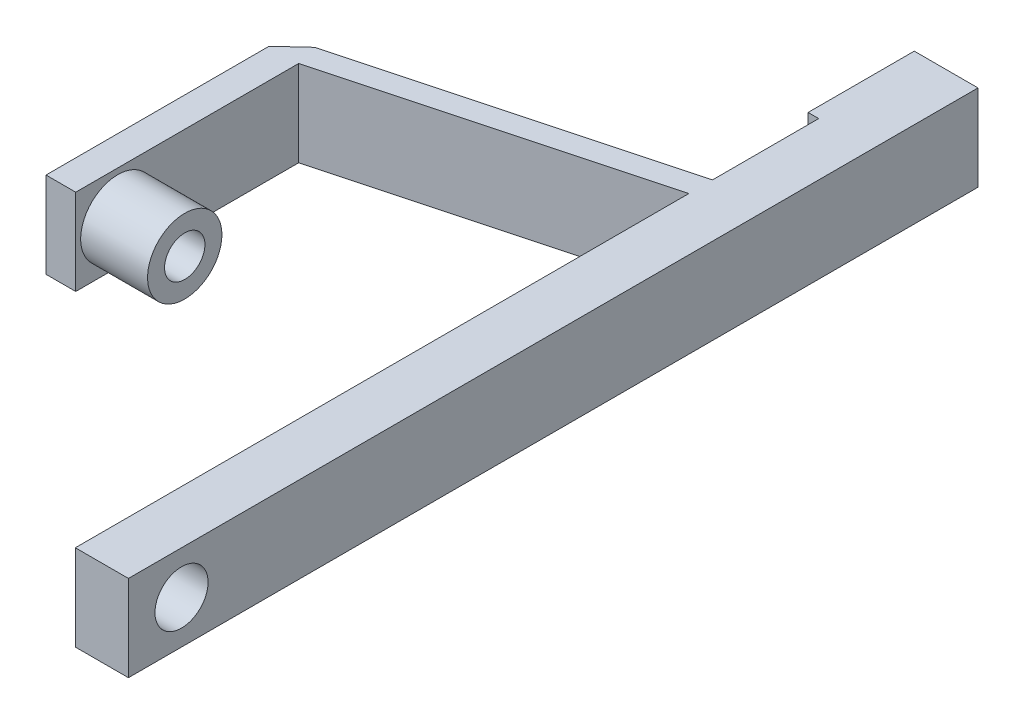
ISO-10303-21;
HEADER;
FILE_DESCRIPTION(('STEP AP214'),'2;1');
FILE_NAME('part.step','',(''),(''),'','','');
FILE_SCHEMA(('AUTOMOTIVE_DESIGN { 1 0 10303 214 1 1 1 1 }'));
ENDSEC;
DATA;
#1=APPLICATION_CONTEXT('core data for automotive mechanical design processes');
#2=APPLICATION_PROTOCOL_DEFINITION('international standard','automotive_design',2000,#1);
#3=PRODUCT_CONTEXT('',#1,'mechanical');
#4=PRODUCT('Part','Part','',(#3));
#5=PRODUCT_RELATED_PRODUCT_CATEGORY('part','',(#4));
#6=PRODUCT_DEFINITION_FORMATION('','',#4);
#7=PRODUCT_DEFINITION_CONTEXT('part definition',#1,'design');
#8=PRODUCT_DEFINITION('design','',#6,#7);
#9=PRODUCT_DEFINITION_SHAPE('','',#8);
#10=(LENGTH_UNIT() NAMED_UNIT(*) SI_UNIT(.MILLI.,.METRE.));
#11=(NAMED_UNIT(*) PLANE_ANGLE_UNIT() SI_UNIT($,.RADIAN.));
#12=(NAMED_UNIT(*) SI_UNIT($,.STERADIAN.) SOLID_ANGLE_UNIT());
#13=UNCERTAINTY_MEASURE_WITH_UNIT(LENGTH_MEASURE(1.E-05),#10,'distance_accuracy_value','');
#14=(GEOMETRIC_REPRESENTATION_CONTEXT(3) GLOBAL_UNCERTAINTY_ASSIGNED_CONTEXT((#13)) GLOBAL_UNIT_ASSIGNED_CONTEXT((#10,
#11,#12)) REPRESENTATION_CONTEXT('',''));
#15=CARTESIAN_POINT('',(0.,0.,0.));
#16=DIRECTION('',(0.,0.,1.));
#17=DIRECTION('',(1.,0.,0.));
#18=AXIS2_PLACEMENT_3D('',#15,#16,#17);
#19=CARTESIAN_POINT('',(-12.6999999999999,20.5739999999995,2.77555756156289E-13));
#20=DIRECTION('',(1.,0.,0.));
#21=DIRECTION('',(0.,0.,-1.));
#22=AXIS2_PLACEMENT_3D('',#19,#20,#21);
#23=PLANE('',#22);
#24=DIRECTION('',(0.,1.00000000000001,0.));
#25=VECTOR('',#24,1.);
#26=CARTESIAN_POINT('',(-12.6999999999999,1.11022302462516E-13,-177.8));
#27=LINE('',#26,#25);
#28=CARTESIAN_POINT('',(-12.6999999999999,1.11022302462516E-13,-177.8));
#29=VERTEX_POINT('',#28);
#30=CARTESIAN_POINT('',(-12.6999999999999,20.5740000000013,-177.8));
#31=VERTEX_POINT('',#30);
#32=EDGE_CURVE('E122',#29,#31,#27,.T.);
#33=ORIENTED_EDGE('',*,*,#32,.F.);
#34=DIRECTION('',(0.,0.,1.));
#35=VECTOR('',#34,1.);
#36=CARTESIAN_POINT('',(-12.6999999999999,0.,3.33066907387547E-13));
#37=LINE('',#36,#35);
#38=CARTESIAN_POINT('',(-12.6999999999999,-4.44089209850063E-13,-152.4));
#39=VERTEX_POINT('',#38);
#40=EDGE_CURVE('E86',#29,#39,#37,.T.);
#41=ORIENTED_EDGE('',*,*,#40,.T.);
#42=DIRECTION('',(0.,-1.00000000000001,0.));
#43=VECTOR('',#42,1.);
#44=CARTESIAN_POINT('',(-12.6999999999999,20.3199999999994,-152.4));
#45=LINE('',#44,#43);
#46=CARTESIAN_POINT('',(-12.6999999999999,20.5740000000018,-152.4));
#47=VERTEX_POINT('',#46);
#48=EDGE_CURVE('E118',#47,#39,#45,.T.);
#49=ORIENTED_EDGE('',*,*,#48,.F.);
#50=DIRECTION('',(0.,0.,1.));
#51=VECTOR('',#50,1.);
#52=CARTESIAN_POINT('',(-12.6999999999999,20.5739999999995,2.77555756156289E-13));
#53=LINE('',#52,#51);
#54=EDGE_CURVE('E166',#31,#47,#53,.T.);
#55=ORIENTED_EDGE('',*,*,#54,.F.);
#56=EDGE_LOOP('',(#33,#41,#49,#55));
#57=FACE_BOUND('',#56,.T.);
#58=ADVANCED_FACE('F40',(#57),#23,.F.);
#59=CARTESIAN_POINT('',(-12.6999999999999,10.2870000000023,-12.6999999999997));
#60=DIRECTION('',(-1.,0.,0.));
#61=DIRECTION('',(0.,0.,1.));
#62=AXIS2_PLACEMENT_3D('',#59,#60,#61);
#63=CIRCLE('',#62,6.35);
#64=CARTESIAN_POINT('',(-12.6999999999999,10.2870000000023,-6.34999999999971));
#65=VERTEX_POINT('',#64);
#66=EDGE_CURVE('E211',#65,#65,#63,.T.);
#67=ORIENTED_EDGE('',*,*,#66,.F.);
#68=EDGE_LOOP('',(#67));
#69=FACE_BOUND('',#68,.T.);
#70=CARTESIAN_POINT('',(-12.6999999999999,20.5739999999999,-146.7612));
#71=VERTEX_POINT('',#70);
#72=CARTESIAN_POINT('',(-12.6999999999999,20.5739999999995,2.77555756156289E-13));
#73=VERTEX_POINT('',#72);
#74=EDGE_CURVE('E165',#71,#73,#53,.T.);
#75=ORIENTED_EDGE('',*,*,#74,.F.);
#76=DIRECTION('',(0.,-1.00000000000001,0.));
#77=VECTOR('',#76,1.);
#78=CARTESIAN_POINT('',(-12.6999999999999,20.3199999999999,-146.7612));
#79=LINE('',#78,#77);
#80=CARTESIAN_POINT('',(-12.6999999999999,0.,-146.761199999999));
#81=VERTEX_POINT('',#80);
#82=EDGE_CURVE('E136',#71,#81,#79,.T.);
#83=ORIENTED_EDGE('',*,*,#82,.T.);
#84=CARTESIAN_POINT('',(-12.6999999999999,0.,3.33066907387547E-13));
#85=VERTEX_POINT('',#84);
#86=EDGE_CURVE('E100',#81,#85,#37,.T.);
#87=ORIENTED_EDGE('',*,*,#86,.T.);
#88=DIRECTION('',(0.,-1.00000000000001,0.));
#89=VECTOR('',#88,1.);
#90=CARTESIAN_POINT('',(-12.6999999999999,20.5739999999995,2.77555756156289E-13));
#91=LINE('',#90,#89);
#92=EDGE_CURVE('E11',#73,#85,#91,.T.);
#93=ORIENTED_EDGE('',*,*,#92,.F.);
#94=EDGE_LOOP('',(#75,#83,#87,#93));
#95=FACE_BOUND('',#94,.T.);
#96=ADVANCED_FACE('F177',(#69,#95),#23,.F.);
#97=CARTESIAN_POINT('',(0.,20.5740000000004,-177.8));
#98=DIRECTION('',(-1.,0.,0.));
#99=DIRECTION('',(0.,0.,1.));
#100=AXIS2_PLACEMENT_3D('',#97,#98,#99);
#101=PLANE('',#100);
#102=CARTESIAN_POINT('',(0.,10.2870000000023,-12.7000000000002));
#103=DIRECTION('',(-1.,0.,0.));
#104=DIRECTION('',(0.,0.,1.));
#105=AXIS2_PLACEMENT_3D('',#102,#103,#104);
#106=CIRCLE('',#105,6.35);
#107=CARTESIAN_POINT('',(0.,10.2870000000023,-6.35000000000016));
#108=VERTEX_POINT('',#107);
#109=EDGE_CURVE('E44',#108,#108,#106,.T.);
#110=ORIENTED_EDGE('',*,*,#109,.T.);
#111=EDGE_LOOP('',(#110));
#112=FACE_BOUND('',#111,.T.);
#113=DIRECTION('',(0.,0.,-1.));
#114=VECTOR('',#113,1.);
#115=CARTESIAN_POINT('',(0.,1.11022302462516E-13,-177.8));
#116=LINE('',#115,#114);
#117=CARTESIAN_POINT('',(0.,0.,0.));
#118=VERTEX_POINT('',#117);
#119=CARTESIAN_POINT('',(2.22044604925031E-13,-3.33066907387547E-13,-203.2));
#120=VERTEX_POINT('',#119);
#121=EDGE_CURVE('E92',#118,#120,#116,.T.);
#122=ORIENTED_EDGE('',*,*,#121,.T.);
#123=DIRECTION('',(0.,-1.00000000000001,0.));
#124=VECTOR('',#123,1.);
#125=CARTESIAN_POINT('',(0.,20.5740000000018,-203.2));
#126=LINE('',#125,#124);
#127=CARTESIAN_POINT('',(0.,20.5740000000018,-203.2));
#128=VERTEX_POINT('',#127);
#129=EDGE_CURVE('E243',#128,#120,#126,.T.);
#130=ORIENTED_EDGE('',*,*,#129,.F.);
#131=DIRECTION('',(0.,0.,-1.));
#132=VECTOR('',#131,1.);
#133=CARTESIAN_POINT('',(0.,20.5740000000004,-177.8));
#134=LINE('',#133,#132);
#135=CARTESIAN_POINT('',(0.,20.5739999999995,0.));
#136=VERTEX_POINT('',#135);
#137=EDGE_CURVE('E85',#136,#128,#134,.T.);
#138=ORIENTED_EDGE('',*,*,#137,.F.);
#139=DIRECTION('',(0.,-1.00000000000001,0.));
#140=VECTOR('',#139,1.);
#141=CARTESIAN_POINT('',(0.,20.5739999999995,0.));
#142=LINE('',#141,#140);
#143=EDGE_CURVE('E49',#136,#118,#142,.T.);
#144=ORIENTED_EDGE('',*,*,#143,.T.);
#145=EDGE_LOOP('',(#122,#130,#138,#144));
#146=FACE_BOUND('',#145,.T.);
#147=ADVANCED_FACE('F42',(#112,#146),#101,.F.);
#148=CARTESIAN_POINT('',(0.,20.5739999999995,0.));
#149=DIRECTION('',(0.,0.,-1.));
#150=DIRECTION('',(-1.,0.,0.));
#151=AXIS2_PLACEMENT_3D('',#148,#149,#150);
#152=PLANE('',#151);
#153=DIRECTION('',(1.,0.,0.));
#154=VECTOR('',#153,1.);
#155=CARTESIAN_POINT('',(0.,0.,0.));
#156=LINE('',#155,#154);
#157=EDGE_CURVE('E77',#85,#118,#156,.T.);
#158=ORIENTED_EDGE('',*,*,#157,.T.);
#159=ORIENTED_EDGE('',*,*,#143,.F.);
#160=DIRECTION('',(1.,0.,0.));
#161=VECTOR('',#160,1.);
#162=CARTESIAN_POINT('',(0.,20.5739999999995,0.));
#163=LINE('',#162,#161);
#164=EDGE_CURVE('E65',#73,#136,#163,.T.);
#165=ORIENTED_EDGE('',*,*,#164,.F.);
#166=ORIENTED_EDGE('',*,*,#92,.T.);
#167=EDGE_LOOP('',(#158,#159,#165,#166));
#168=FACE_BOUND('',#167,.T.);
#169=ADVANCED_FACE('F79',(#168),#152,.F.);
#170=CARTESIAN_POINT('',(0.,20.5739999999995,0.));
#171=DIRECTION('',(0.,-1.00000000000001,0.));
#172=DIRECTION('',(0.,0.,-1.));
#173=AXIS2_PLACEMENT_3D('',#170,#171,#172);
#174=PLANE('',#173);
#175=ORIENTED_EDGE('',*,*,#137,.T.);
#176=DIRECTION('',(1.,0.,0.));
#177=VECTOR('',#176,1.);
#178=CARTESIAN_POINT('',(-12.6999999999999,20.5740000000026,-203.2));
#179=LINE('',#178,#177);
#180=CARTESIAN_POINT('',(-15.2399999999999,20.5740000000026,-203.2));
#181=VERTEX_POINT('',#180);
#182=EDGE_CURVE('E239',#181,#128,#179,.T.);
#183=ORIENTED_EDGE('',*,*,#182,.F.);
#184=DIRECTION('',(0.,0.,-1.));
#185=VECTOR('',#184,1.);
#186=CARTESIAN_POINT('',(-15.2399999999999,20.5740000000022,-177.8));
#187=LINE('',#186,#185);
#188=CARTESIAN_POINT('',(-15.2399999999999,20.5740000000022,-177.8));
#189=VERTEX_POINT('',#188);
#190=EDGE_CURVE('E250',#189,#181,#187,.T.);
#191=ORIENTED_EDGE('',*,*,#190,.F.);
#192=DIRECTION('',(1.,0.,0.));
#193=VECTOR('',#192,1.);
#194=CARTESIAN_POINT('',(-15.2399999999999,20.5740000000022,-177.8));
#195=LINE('',#194,#193);
#196=EDGE_CURVE('E248',#189,#31,#195,.T.);
#197=ORIENTED_EDGE('',*,*,#196,.T.);
#198=ORIENTED_EDGE('',*,*,#54,.T.);
#199=DIRECTION('',(-0.965925826289068,0.,0.258819045102522));
#200=VECTOR('',#199,1.);
#201=CARTESIAN_POINT('',(-12.6999999999999,20.5740000000018,-152.4));
#202=LINE('',#201,#200);
#203=CARTESIAN_POINT('',(-87.7132479632283,20.5740000000025,-132.300260786618));
#204=VERTEX_POINT('',#203);
#205=EDGE_CURVE('E135',#47,#204,#202,.T.);
#206=ORIENTED_EDGE('',*,*,#205,.T.);
#207=DIRECTION('',(-0.734969770731576,0.,0.678099871782009));
#208=VECTOR('',#207,1.);
#209=CARTESIAN_POINT('',(-87.7132479632283,20.5740000000025,-132.300260786618));
#210=LINE('',#209,#208);
#211=CARTESIAN_POINT('',(-93.4155479632284,20.5740000000026,-127.039188763187));
#212=VERTEX_POINT('',#211);
#213=EDGE_CURVE('E210',#204,#212,#210,.T.);
#214=ORIENTED_EDGE('',*,*,#213,.T.);
#215=DIRECTION('',(0.,0.,1.));
#216=VECTOR('',#215,1.);
#217=CARTESIAN_POINT('',(-93.4155479632284,20.5740000000026,-127.039188763187));
#218=LINE('',#217,#216);
#219=CARTESIAN_POINT('',(-93.4155479632268,20.5740000000004,-73.6991887631874));
#220=VERTEX_POINT('',#219);
#221=EDGE_CURVE('E194',#212,#220,#218,.T.);
#222=ORIENTED_EDGE('',*,*,#221,.T.);
#223=DIRECTION('',(1.,0.,0.));
#224=VECTOR('',#223,1.);
#225=CARTESIAN_POINT('',(-93.4155479632268,20.5740000000004,-73.6991887631874));
#226=LINE('',#225,#224);
#227=CARTESIAN_POINT('',(-86.303547963227,20.5740000000004,-73.6991887631874));
#228=VERTEX_POINT('',#227);
#229=EDGE_CURVE('E208',#220,#228,#226,.T.);
#230=ORIENTED_EDGE('',*,*,#229,.T.);
#231=DIRECTION('',(0.,0.,-1.));
#232=VECTOR('',#231,1.);
#233=CARTESIAN_POINT('',(-86.303547963227,20.5740000000004,-73.6991887631874));
#234=LINE('',#233,#232);
#235=CARTESIAN_POINT('',(-86.3035479632284,20.5740000000026,-127.039188763187));
#236=VERTEX_POINT('',#235);
#237=EDGE_CURVE('E218',#228,#236,#234,.T.);
#238=ORIENTED_EDGE('',*,*,#237,.T.);
#239=DIRECTION('',(0.965925826289068,0.,-0.258819045102521));
#240=VECTOR('',#239,1.);
#241=CARTESIAN_POINT('',(-86.3035479632284,20.5740000000026,-127.039188763187));
#242=LINE('',#241,#240);
#243=EDGE_CURVE('E175',#236,#71,#242,.T.);
#244=ORIENTED_EDGE('',*,*,#243,.T.);
#245=ORIENTED_EDGE('',*,*,#74,.T.);
#246=ORIENTED_EDGE('',*,*,#164,.T.);
#247=EDGE_LOOP('',(#175,#183,#191,#197,#198,#206,#214,#222,#230,#238,#244,#245,#246));
#248=FACE_BOUND('',#247,.T.);
#249=ADVANCED_FACE('F171',(#248),#174,.F.);
#250=CARTESIAN_POINT('',(0.,0.,0.));
#251=DIRECTION('',(0.,-1.00000000000001,0.));
#252=DIRECTION('',(0.,0.,-1.));
#253=AXIS2_PLACEMENT_3D('',#250,#251,#252);
#254=PLANE('',#253);
#255=ORIENTED_EDGE('',*,*,#121,.F.);
#256=ORIENTED_EDGE('',*,*,#157,.F.);
#257=ORIENTED_EDGE('',*,*,#86,.F.);
#258=DIRECTION('',(-0.965925826289068,0.,0.258819045102522));
#259=VECTOR('',#258,1.);
#260=CARTESIAN_POINT('',(-37.5410386859687,0.,-140.105063744944));
#261=LINE('',#260,#259);
#262=CARTESIAN_POINT('',(-86.3035479632284,2.22044604925031E-12,-127.039188763188));
#263=VERTEX_POINT('',#262);
#264=EDGE_CURVE('E56',#81,#263,#261,.T.);
#265=ORIENTED_EDGE('',*,*,#264,.T.);
#266=DIRECTION('',(0.,0.,1.));
#267=VECTOR('',#266,1.);
#268=CARTESIAN_POINT('',(-86.303547963227,0.,2.77555756156289E-13));
#269=LINE('',#268,#267);
#270=CARTESIAN_POINT('',(-86.3035479632266,0.,-73.6991887631875));
#271=VERTEX_POINT('',#270);
#272=EDGE_CURVE('E143',#263,#271,#269,.T.);
#273=ORIENTED_EDGE('',*,*,#272,.T.);
#274=DIRECTION('',(-1.,0.,0.));
#275=VECTOR('',#274,1.);
#276=CARTESIAN_POINT('',(0.,2.33146835171283E-12,-73.699188763188));
#277=LINE('',#276,#275);
#278=CARTESIAN_POINT('',(-93.4155479632268,0.,-73.6991887631876));
#279=VERTEX_POINT('',#278);
#280=EDGE_CURVE('E150',#271,#279,#277,.T.);
#281=ORIENTED_EDGE('',*,*,#280,.T.);
#282=DIRECTION('',(0.,0.,-1.));
#283=VECTOR('',#282,1.);
#284=CARTESIAN_POINT('',(-93.415547963227,1.33226762955019E-12,2.22044604925031E-13));
#285=LINE('',#284,#283);
#286=CARTESIAN_POINT('',(-93.4155479632284,2.33146835171283E-12,-127.039188763188));
#287=VERTEX_POINT('',#286);
#288=EDGE_CURVE('E153',#279,#287,#285,.T.);
#289=ORIENTED_EDGE('',*,*,#288,.T.);
#290=DIRECTION('',(0.734969770731576,0.,-0.678099871782009));
#291=VECTOR('',#290,1.);
#292=CARTESIAN_POINT('',(-106.268444824847,2.22044604925031E-12,-115.180813002759));
#293=LINE('',#292,#291);
#294=CARTESIAN_POINT('',(-87.7132479632283,-4.44089209850063E-13,-132.300260786618));
#295=VERTEX_POINT('',#294);
#296=EDGE_CURVE('E141',#287,#295,#293,.T.);
#297=ORIENTED_EDGE('',*,*,#296,.T.);
#298=DIRECTION('',(0.965925826289068,0.,-0.258819045102522));
#299=VECTOR('',#298,1.);
#300=CARTESIAN_POINT('',(-38.9507386859689,2.22044604925031E-12,-145.366135768374));
#301=LINE('',#300,#299);
#302=EDGE_CURVE('E132',#295,#39,#301,.T.);
#303=ORIENTED_EDGE('',*,*,#302,.T.);
#304=ORIENTED_EDGE('',*,*,#40,.F.);
#305=DIRECTION('',(1.,0.,0.));
#306=VECTOR('',#305,1.);
#307=CARTESIAN_POINT('',(-15.2399999999999,1.11022302462516E-13,-177.8));
#308=LINE('',#307,#306);
#309=CARTESIAN_POINT('',(-15.2399999999999,1.11022302462516E-13,-177.8));
#310=VERTEX_POINT('',#309);
#311=EDGE_CURVE('E245',#310,#29,#308,.T.);
#312=ORIENTED_EDGE('',*,*,#311,.F.);
#313=DIRECTION('',(0.,0.,1.));
#314=VECTOR('',#313,1.);
#315=CARTESIAN_POINT('',(-15.2399999999999,-3.33066907387547E-13,-203.2));
#316=LINE('',#315,#314);
#317=CARTESIAN_POINT('',(-15.2399999999999,-3.33066907387547E-13,-203.2));
#318=VERTEX_POINT('',#317);
#319=EDGE_CURVE('E258',#318,#310,#316,.T.);
#320=ORIENTED_EDGE('',*,*,#319,.F.);
#321=DIRECTION('',(-1.,0.,0.));
#322=VECTOR('',#321,1.);
#323=CARTESIAN_POINT('',(2.22044604925031E-13,-3.33066907387547E-13,-203.2));
#324=LINE('',#323,#322);
#325=EDGE_CURVE('E98',#120,#318,#324,.T.);
#326=ORIENTED_EDGE('',*,*,#325,.F.);
#327=EDGE_LOOP('',(#255,#256,#257,#265,#273,#281,#289,#297,#303,#304,#312,#320,#326));
#328=FACE_BOUND('',#327,.T.);
#329=ADVANCED_FACE('F95',(#328),#254,.T.);
#330=CARTESIAN_POINT('',(-106.268444824847,20.3200000000026,-115.180813002759));
#331=DIRECTION('',(-0.678099871782008,0.,-0.734969770731576));
#332=DIRECTION('',(-0.734969770731576,0.,0.678099871782009));
#333=AXIS2_PLACEMENT_3D('',#330,#331,#332);
#334=PLANE('',#333);
#335=ORIENTED_EDGE('',*,*,#296,.F.);
#336=DIRECTION('',(0.,-1.00000000000001,0.));
#337=VECTOR('',#336,1.);
#338=CARTESIAN_POINT('',(-93.4155479632284,20.3200000000022,-127.039188763188));
#339=LINE('',#338,#337);
#340=EDGE_CURVE('E101',#212,#287,#339,.T.);
#341=ORIENTED_EDGE('',*,*,#340,.F.);
#342=ORIENTED_EDGE('',*,*,#213,.F.);
#343=DIRECTION('',(0.,-1.00000000000001,0.));
#344=VECTOR('',#343,1.);
#345=CARTESIAN_POINT('',(-87.7132479632283,20.3199999999994,-132.300260786618));
#346=LINE('',#345,#344);
#347=EDGE_CURVE('E137',#204,#295,#346,.T.);
#348=ORIENTED_EDGE('',*,*,#347,.T.);
#349=EDGE_LOOP('',(#335,#341,#342,#348));
#350=FACE_BOUND('',#349,.T.);
#351=ADVANCED_FACE('F198',(#350),#334,.T.);
#352=CARTESIAN_POINT('',(-93.415547963227,20.3199999999996,2.77555756156289E-13));
#353=DIRECTION('',(-1.,0.,0.));
#354=DIRECTION('',(0.,0.,1.));
#355=AXIS2_PLACEMENT_3D('',#352,#353,#354);
#356=PLANE('',#355);
#357=CARTESIAN_POINT('',(-93.415547963227,10.2869999999996,-83.7702887631879));
#358=DIRECTION('',(-1.,0.,0.));
#359=DIRECTION('',(0.,0.,1.));
#360=AXIS2_PLACEMENT_3D('',#357,#358,#359);
#361=CIRCLE('',#360,6.00709999999999);
#362=CARTESIAN_POINT('',(-93.415547963227,10.2869999999996,-77.7631887631879));
#363=VERTEX_POINT('',#362);
#364=EDGE_CURVE('E222',#363,#363,#361,.T.);
#365=ORIENTED_EDGE('',*,*,#364,.F.);
#366=EDGE_LOOP('',(#365));
#367=FACE_BOUND('',#366,.T.);
#368=ORIENTED_EDGE('',*,*,#288,.F.);
#369=DIRECTION('',(0.,-1.00000000000001,0.));
#370=VECTOR('',#369,1.);
#371=CARTESIAN_POINT('',(-93.4155479632268,20.3200000000027,-73.6991887631878));
#372=LINE('',#371,#370);
#373=EDGE_CURVE('E105',#220,#279,#372,.T.);
#374=ORIENTED_EDGE('',*,*,#373,.F.);
#375=ORIENTED_EDGE('',*,*,#221,.F.);
#376=ORIENTED_EDGE('',*,*,#340,.T.);
#377=EDGE_LOOP('',(#368,#374,#375,#376));
#378=FACE_BOUND('',#377,.T.);
#379=ADVANCED_FACE('F190',(#367,#378),#356,.T.);
#380=CARTESIAN_POINT('',(0.,20.3200000000027,-73.6991887631878));
#381=DIRECTION('',(0.,0.,1.));
#382=DIRECTION('',(1.,0.,0.));
#383=AXIS2_PLACEMENT_3D('',#380,#381,#382);
#384=PLANE('',#383);
#385=ORIENTED_EDGE('',*,*,#280,.F.);
#386=DIRECTION('',(0.,-1.00000000000001,0.));
#387=VECTOR('',#386,1.);
#388=CARTESIAN_POINT('',(-86.303547963227,20.3200000000027,-73.6991887631878));
#389=LINE('',#388,#387);
#390=EDGE_CURVE('E157',#228,#271,#389,.T.);
#391=ORIENTED_EDGE('',*,*,#390,.F.);
#392=ORIENTED_EDGE('',*,*,#229,.F.);
#393=ORIENTED_EDGE('',*,*,#373,.T.);
#394=EDGE_LOOP('',(#385,#391,#392,#393));
#395=FACE_BOUND('',#394,.T.);
#396=ADVANCED_FACE('F202',(#395),#384,.T.);
#397=CARTESIAN_POINT('',(-86.303547963227,20.3199999999996,2.77555756156289E-13));
#398=DIRECTION('',(1.,0.,0.));
#399=DIRECTION('',(0.,0.,-1.));
#400=AXIS2_PLACEMENT_3D('',#397,#398,#399);
#401=PLANE('',#400);
#402=CARTESIAN_POINT('',(-86.3035479632273,10.2869999999996,-83.7702887631879));
#403=DIRECTION('',(1.,0.,0.));
#404=DIRECTION('',(0.,0.,-1.));
#405=AXIS2_PLACEMENT_3D('',#402,#403,#404);
#406=CIRCLE('',#405,8.89);
#407=CARTESIAN_POINT('',(-86.3035479632273,10.2869999999996,-92.6602887631879));
#408=VERTEX_POINT('',#407);
#409=EDGE_CURVE('E231',#408,#408,#406,.T.);
#410=ORIENTED_EDGE('',*,*,#409,.F.);
#411=EDGE_LOOP('',(#410));
#412=FACE_BOUND('',#411,.T.);
#413=ORIENTED_EDGE('',*,*,#272,.F.);
#414=DIRECTION('',(0.,-1.00000000000001,0.));
#415=VECTOR('',#414,1.);
#416=CARTESIAN_POINT('',(-86.3035479632284,20.3200000000022,-127.039188763188));
#417=LINE('',#416,#415);
#418=EDGE_CURVE('E160',#236,#263,#417,.T.);
#419=ORIENTED_EDGE('',*,*,#418,.F.);
#420=ORIENTED_EDGE('',*,*,#237,.F.);
#421=ORIENTED_EDGE('',*,*,#390,.T.);
#422=EDGE_LOOP('',(#413,#419,#420,#421));
#423=FACE_BOUND('',#422,.T.);
#424=ADVANCED_FACE('F293',(#412,#423),#401,.T.);
#425=CARTESIAN_POINT('',(-37.5410386859687,20.3199999999996,-140.105063744945));
#426=DIRECTION('',(0.25881904510252,0.,0.965925826289068));
#427=DIRECTION('',(0.965925826289068,0.,-0.258819045102522));
#428=AXIS2_PLACEMENT_3D('',#425,#426,#427);
#429=PLANE('',#428);
#430=ORIENTED_EDGE('',*,*,#264,.F.);
#431=ORIENTED_EDGE('',*,*,#82,.F.);
#432=ORIENTED_EDGE('',*,*,#243,.F.);
#433=ORIENTED_EDGE('',*,*,#418,.T.);
#434=EDGE_LOOP('',(#430,#431,#432,#433));
#435=FACE_BOUND('',#434,.T.);
#436=ADVANCED_FACE('F291',(#435),#429,.T.);
#437=CARTESIAN_POINT('',(-38.9507386859689,20.3200000000022,-145.366135768374));
#438=DIRECTION('',(-0.258819045102521,0.,-0.965925826289068));
#439=DIRECTION('',(-0.965925826289068,0.,0.258819045102522));
#440=AXIS2_PLACEMENT_3D('',#437,#438,#439);
#441=PLANE('',#440);
#442=ORIENTED_EDGE('',*,*,#302,.F.);
#443=ORIENTED_EDGE('',*,*,#347,.F.);
#444=ORIENTED_EDGE('',*,*,#205,.F.);
#445=ORIENTED_EDGE('',*,*,#48,.T.);
#446=EDGE_LOOP('',(#442,#443,#444,#445));
#447=FACE_BOUND('',#446,.T.);
#448=ADVANCED_FACE('F130',(#447),#441,.T.);
#449=CARTESIAN_POINT('',(7.61999999999996,10.2870000000023,-12.7000000000002));
#450=DIRECTION('',(-1.,0.,0.));
#451=DIRECTION('',(0.,0.,1.));
#452=AXIS2_PLACEMENT_3D('',#449,#450,#451);
#453=CYLINDRICAL_SURFACE('',#452,6.35);
#454=ORIENTED_EDGE('',*,*,#66,.T.);
#455=EDGE_LOOP('',(#454));
#456=FACE_BOUND('',#455,.T.);
#457=ORIENTED_EDGE('',*,*,#109,.F.);
#458=EDGE_LOOP('',(#457));
#459=FACE_BOUND('',#458,.T.);
#460=ADVANCED_FACE('F299',(#456,#459),#453,.F.);
#461=CARTESIAN_POINT('',(-92.9075479632271,10.2869999999996,-83.7702887631879));
#462=DIRECTION('',(-1.,0.,0.));
#463=DIRECTION('',(0.,0.,1.));
#464=AXIS2_PLACEMENT_3D('',#461,#462,#463);
#465=CYLINDRICAL_SURFACE('',#464,6.00709999999999);
#466=CARTESIAN_POINT('',(-92.9075479632271,10.2869999999996,-83.7702887631879));
#467=DIRECTION('',(-1.,0.,0.));
#468=DIRECTION('',(0.,0.,1.));
#469=AXIS2_PLACEMENT_3D('',#466,#467,#468);
#470=CIRCLE('',#469,6.00709999999999);
#471=CARTESIAN_POINT('',(-92.9075479632271,10.2869999999996,-77.7631887631879));
#472=VERTEX_POINT('',#471);
#473=EDGE_CURVE('E221',#472,#472,#470,.T.);
#474=ORIENTED_EDGE('',*,*,#473,.F.);
#475=EDGE_LOOP('',(#474));
#476=FACE_BOUND('',#475,.T.);
#477=ORIENTED_EDGE('',*,*,#364,.T.);
#478=EDGE_LOOP('',(#477));
#479=FACE_BOUND('',#478,.T.);
#480=ADVANCED_FACE('F329',(#476,#479),#465,.F.);
#481=CARTESIAN_POINT('',(-92.9075479632271,10.2869999999996,-83.7702887631879));
#482=DIRECTION('',(-1.,0.,0.));
#483=DIRECTION('',(0.,0.,1.));
#484=AXIS2_PLACEMENT_3D('',#481,#482,#483);
#485=PLANE('',#484);
#486=CARTESIAN_POINT('',(-92.9075479632271,10.2869999999996,-83.7702887631879));
#487=DIRECTION('',(-1.,0.,0.));
#488=DIRECTION('',(0.,0.,1.));
#489=AXIS2_PLACEMENT_3D('',#486,#487,#488);
#490=CIRCLE('',#489,4.826);
#491=CARTESIAN_POINT('',(-92.9075479632271,10.2869999999996,-78.9442887631879));
#492=VERTEX_POINT('',#491);
#493=EDGE_CURVE('E225',#492,#492,#490,.T.);
#494=ORIENTED_EDGE('',*,*,#493,.F.);
#495=EDGE_LOOP('',(#494));
#496=FACE_BOUND('',#495,.T.);
#497=ORIENTED_EDGE('',*,*,#473,.T.);
#498=EDGE_LOOP('',(#497));
#499=FACE_BOUND('',#498,.T.);
#500=ADVANCED_FACE('F333',(#496,#499),#485,.T.);
#501=CARTESIAN_POINT('',(-70.047547963227,10.2869999999996,-83.7702887631883));
#502=DIRECTION('',(-1.,0.,0.));
#503=DIRECTION('',(0.,0.,1.));
#504=AXIS2_PLACEMENT_3D('',#501,#502,#503);
#505=CYLINDRICAL_SURFACE('',#504,4.826);
#506=ORIENTED_EDGE('',*,*,#493,.T.);
#507=EDGE_LOOP('',(#506));
#508=FACE_BOUND('',#507,.T.);
#509=CARTESIAN_POINT('',(-70.301547963227,10.2869999999996,-83.7702887631883));
#510=DIRECTION('',(1.,0.,0.));
#511=DIRECTION('',(0.,0.,-1.));
#512=AXIS2_PLACEMENT_3D('',#509,#510,#511);
#513=CIRCLE('',#512,4.826);
#514=CARTESIAN_POINT('',(-70.301547963227,10.2869999999996,-88.5962887631883));
#515=VERTEX_POINT('',#514);
#516=EDGE_CURVE('E234',#515,#515,#513,.T.);
#517=ORIENTED_EDGE('',*,*,#516,.T.);
#518=EDGE_LOOP('',(#517));
#519=FACE_BOUND('',#518,.T.);
#520=ADVANCED_FACE('F337',(#508,#519),#505,.F.);
#521=CARTESIAN_POINT('',(-70.301547963227,10.2869999999996,-83.7702887631883));
#522=DIRECTION('',(1.,0.,0.));
#523=DIRECTION('',(0.,0.,-1.));
#524=AXIS2_PLACEMENT_3D('',#521,#522,#523);
#525=PLANE('',#524);
#526=CARTESIAN_POINT('',(-70.301547963227,10.2869999999996,-83.7702887631883));
#527=DIRECTION('',(1.,0.,0.));
#528=DIRECTION('',(0.,0.,-1.));
#529=AXIS2_PLACEMENT_3D('',#526,#527,#528);
#530=CIRCLE('',#529,8.89);
#531=CARTESIAN_POINT('',(-70.301547963227,10.2869999999996,-92.6602887631883));
#532=VERTEX_POINT('',#531);
#533=EDGE_CURVE('E230',#532,#532,#530,.T.);
#534=ORIENTED_EDGE('',*,*,#533,.T.);
#535=EDGE_LOOP('',(#534));
#536=FACE_BOUND('',#535,.T.);
#537=ORIENTED_EDGE('',*,*,#516,.F.);
#538=EDGE_LOOP('',(#537));
#539=FACE_BOUND('',#538,.T.);
#540=ADVANCED_FACE('F341',(#536,#539),#525,.T.);
#541=CARTESIAN_POINT('',(-70.301547963227,10.2869999999996,-83.7702887631883));
#542=DIRECTION('',(-1.,0.,0.));
#543=DIRECTION('',(0.,0.,1.));
#544=AXIS2_PLACEMENT_3D('',#541,#542,#543);
#545=CYLINDRICAL_SURFACE('',#544,8.89);
#546=ORIENTED_EDGE('',*,*,#533,.F.);
#547=EDGE_LOOP('',(#546));
#548=FACE_BOUND('',#547,.T.);
#549=ORIENTED_EDGE('',*,*,#409,.T.);
#550=EDGE_LOOP('',(#549));
#551=FACE_BOUND('',#550,.T.);
#552=ADVANCED_FACE('F343',(#548,#551),#545,.T.);
#553=CARTESIAN_POINT('',(2.22044604925031E-13,-3.33066907387547E-13,-203.2));
#554=DIRECTION('',(0.,0.,-1.));
#555=DIRECTION('',(-1.,0.,0.));
#556=AXIS2_PLACEMENT_3D('',#553,#554,#555);
#557=PLANE('',#556);
#558=ORIENTED_EDGE('',*,*,#129,.T.);
#559=ORIENTED_EDGE('',*,*,#325,.T.);
#560=DIRECTION('',(0.,-1.00000000000001,0.));
#561=VECTOR('',#560,1.);
#562=CARTESIAN_POINT('',(-15.2399999999999,20.5740000000026,-203.2));
#563=LINE('',#562,#561);
#564=EDGE_CURVE('E252',#181,#318,#563,.T.);
#565=ORIENTED_EDGE('',*,*,#564,.F.);
#566=ORIENTED_EDGE('',*,*,#182,.T.);
#567=EDGE_LOOP('',(#558,#559,#565,#566));
#568=FACE_BOUND('',#567,.T.);
#569=ADVANCED_FACE('F272',(#568),#557,.T.);
#570=CARTESIAN_POINT('',(-15.2399999999999,1.11022302462516E-13,-177.8));
#571=DIRECTION('',(0.,0.,-1.));
#572=DIRECTION('',(-1.,0.,0.));
#573=AXIS2_PLACEMENT_3D('',#570,#571,#572);
#574=PLANE('',#573);
#575=ORIENTED_EDGE('',*,*,#32,.T.);
#576=ORIENTED_EDGE('',*,*,#196,.F.);
#577=DIRECTION('',(0.,1.00000000000001,0.));
#578=VECTOR('',#577,1.);
#579=CARTESIAN_POINT('',(-15.2399999999999,1.11022302462516E-13,-177.8));
#580=LINE('',#579,#578);
#581=EDGE_CURVE('E255',#310,#189,#580,.T.);
#582=ORIENTED_EDGE('',*,*,#581,.F.);
#583=ORIENTED_EDGE('',*,*,#311,.T.);
#584=EDGE_LOOP('',(#575,#576,#582,#583));
#585=FACE_BOUND('',#584,.T.);
#586=ADVANCED_FACE('F352',(#585),#574,.F.);
#587=CARTESIAN_POINT('',(-15.2399999999999,0.,3.33066907387547E-13));
#588=DIRECTION('',(-1.,0.,0.));
#589=DIRECTION('',(0.,0.,1.));
#590=AXIS2_PLACEMENT_3D('',#587,#588,#589);
#591=PLANE('',#590);
#592=ORIENTED_EDGE('',*,*,#564,.T.);
#593=ORIENTED_EDGE('',*,*,#319,.T.);
#594=ORIENTED_EDGE('',*,*,#581,.T.);
#595=ORIENTED_EDGE('',*,*,#190,.T.);
#596=EDGE_LOOP('',(#592,#593,#594,#595));
#597=FACE_BOUND('',#596,.T.);
#598=ADVANCED_FACE('F265',(#597),#591,.T.);
#599=CLOSED_SHELL('',(#58,#96,#147,#169,#249,#329,#351,#379,#396,#424,#436,#448,#460,#480,#500,
#520,#540,#552,#569,#586,#598));
#600=MANIFOLD_SOLID_BREP('B2',#599);
#601=ADVANCED_BREP_SHAPE_REPRESENTATION('',(#18,#600),#14);
#602=SHAPE_DEFINITION_REPRESENTATION(#9,#601);
ENDSEC;
END-ISO-10303-21;
